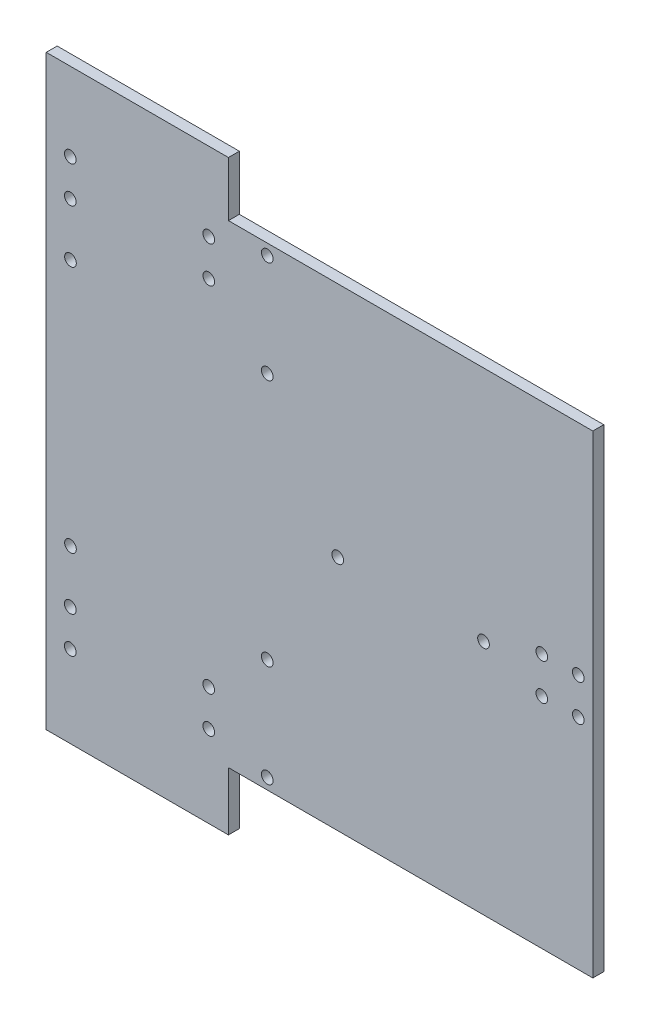
ISO-10303-21;
HEADER;
FILE_DESCRIPTION(('STEP AP214'),'2;1');
FILE_NAME('part.step','',(''),(''),'','','');
FILE_SCHEMA(('AUTOMOTIVE_DESIGN { 1 0 10303 214 1 1 1 1 }'));
ENDSEC;
DATA;
#1=APPLICATION_CONTEXT('core data for automotive mechanical design processes');
#2=APPLICATION_PROTOCOL_DEFINITION('international standard','automotive_design',2000,#1);
#3=PRODUCT_CONTEXT('',#1,'mechanical');
#4=PRODUCT('Part','Part','',(#3));
#5=PRODUCT_RELATED_PRODUCT_CATEGORY('part','',(#4));
#6=PRODUCT_DEFINITION_FORMATION('','',#4);
#7=PRODUCT_DEFINITION_CONTEXT('part definition',#1,'design');
#8=PRODUCT_DEFINITION('design','',#6,#7);
#9=PRODUCT_DEFINITION_SHAPE('','',#8);
#10=(LENGTH_UNIT() NAMED_UNIT(*) SI_UNIT(.MILLI.,.METRE.));
#11=(NAMED_UNIT(*) PLANE_ANGLE_UNIT() SI_UNIT($,.RADIAN.));
#12=(NAMED_UNIT(*) SI_UNIT($,.STERADIAN.) SOLID_ANGLE_UNIT());
#13=UNCERTAINTY_MEASURE_WITH_UNIT(LENGTH_MEASURE(1.E-05),#10,'distance_accuracy_value','');
#14=(GEOMETRIC_REPRESENTATION_CONTEXT(3) GLOBAL_UNCERTAINTY_ASSIGNED_CONTEXT((#13)) GLOBAL_UNIT_ASSIGNED_CONTEXT((#10,
#11,#12)) REPRESENTATION_CONTEXT('',''));
#15=CARTESIAN_POINT('',(0.,0.,0.));
#16=DIRECTION('',(0.,0.,1.));
#17=DIRECTION('',(1.,0.,0.));
#18=AXIS2_PLACEMENT_3D('',#15,#16,#17);
#19=CARTESIAN_POINT('',(-75.,65.,3.));
#20=DIRECTION('',(0.,-1.,0.));
#21=DIRECTION('',(0.,0.,-1.));
#22=AXIS2_PLACEMENT_3D('',#19,#20,#21);
#23=PLANE('',#22);
#24=DIRECTION('',(0.,0.,-1.));
#25=VECTOR('',#24,1.);
#26=CARTESIAN_POINT('',(-25.,65.,3.));
#27=LINE('',#26,#25);
#28=CARTESIAN_POINT('',(-25.,65.,3.));
#29=VERTEX_POINT('',#28);
#30=CARTESIAN_POINT('',(-25.,65.,0.));
#31=VERTEX_POINT('',#30);
#32=EDGE_CURVE('E60',#29,#31,#27,.T.);
#33=ORIENTED_EDGE('',*,*,#32,.F.);
#34=DIRECTION('',(-1.,0.,0.));
#35=VECTOR('',#34,1.);
#36=CARTESIAN_POINT('',(-75.,65.,3.));
#37=LINE('',#36,#35);
#38=CARTESIAN_POINT('',(75.,65.,3.));
#39=VERTEX_POINT('',#38);
#40=EDGE_CURVE('E125',#39,#29,#37,.T.);
#41=ORIENTED_EDGE('',*,*,#40,.F.);
#42=DIRECTION('',(0.,0.,-1.));
#43=VECTOR('',#42,1.);
#44=CARTESIAN_POINT('',(75.,65.,3.));
#45=LINE('',#44,#43);
#46=CARTESIAN_POINT('',(75.,65.,0.));
#47=VERTEX_POINT('',#46);
#48=EDGE_CURVE('E11',#39,#47,#45,.T.);
#49=ORIENTED_EDGE('',*,*,#48,.T.);
#50=DIRECTION('',(-1.,0.,0.));
#51=VECTOR('',#50,1.);
#52=CARTESIAN_POINT('',(-75.,65.,0.));
#53=LINE('',#52,#51);
#54=EDGE_CURVE('E132',#47,#31,#53,.T.);
#55=ORIENTED_EDGE('',*,*,#54,.T.);
#56=EDGE_LOOP('',(#33,#41,#49,#55));
#57=FACE_BOUND('',#56,.T.);
#58=ADVANCED_FACE('F35',(#57),#23,.F.);
#59=CARTESIAN_POINT('',(75.,-65.,3.));
#60=DIRECTION('',(-1.,0.,0.));
#61=DIRECTION('',(0.,0.,1.));
#62=AXIS2_PLACEMENT_3D('',#59,#60,#61);
#63=PLANE('',#62);
#64=DIRECTION('',(0.,1.,0.));
#65=VECTOR('',#64,1.);
#66=CARTESIAN_POINT('',(75.,-65.,0.));
#67=LINE('',#66,#65);
#68=CARTESIAN_POINT('',(75.,-65.,0.));
#69=VERTEX_POINT('',#68);
#70=EDGE_CURVE('E129',#69,#47,#67,.T.);
#71=ORIENTED_EDGE('',*,*,#70,.T.);
#72=ORIENTED_EDGE('',*,*,#48,.F.);
#73=DIRECTION('',(0.,1.,0.));
#74=VECTOR('',#73,1.);
#75=CARTESIAN_POINT('',(75.,-65.,3.));
#76=LINE('',#75,#74);
#77=CARTESIAN_POINT('',(75.,-65.,3.));
#78=VERTEX_POINT('',#77);
#79=EDGE_CURVE('E137',#78,#39,#76,.T.);
#80=ORIENTED_EDGE('',*,*,#79,.F.);
#81=DIRECTION('',(0.,0.,-1.));
#82=VECTOR('',#81,1.);
#83=CARTESIAN_POINT('',(75.,-65.,3.));
#84=LINE('',#83,#82);
#85=EDGE_CURVE('E44',#78,#69,#84,.T.);
#86=ORIENTED_EDGE('',*,*,#85,.T.);
#87=EDGE_LOOP('',(#71,#72,#80,#86));
#88=FACE_BOUND('',#87,.T.);
#89=ADVANCED_FACE('F37',(#88),#63,.F.);
#90=CARTESIAN_POINT('',(-75.,-65.,3.));
#91=DIRECTION('',(1.,0.,0.));
#92=DIRECTION('',(0.,0.,-1.));
#93=AXIS2_PLACEMENT_3D('',#90,#91,#92);
#94=PLANE('',#93);
#95=DIRECTION('',(0.,-1.,0.));
#96=VECTOR('',#95,1.);
#97=CARTESIAN_POINT('',(-75.,-65.,0.));
#98=LINE('',#97,#96);
#99=CARTESIAN_POINT('',(-75.,80.,0.));
#100=VERTEX_POINT('',#99);
#101=CARTESIAN_POINT('',(-75.,-81.,0.));
#102=VERTEX_POINT('',#101);
#103=EDGE_CURVE('E134',#100,#102,#98,.T.);
#104=ORIENTED_EDGE('',*,*,#103,.T.);
#105=DIRECTION('',(0.,0.,-1.));
#106=VECTOR('',#105,1.);
#107=CARTESIAN_POINT('',(-75.,-81.,3.));
#108=LINE('',#107,#106);
#109=CARTESIAN_POINT('',(-75.,-81.,3.));
#110=VERTEX_POINT('',#109);
#111=EDGE_CURVE('E206',#110,#102,#108,.T.);
#112=ORIENTED_EDGE('',*,*,#111,.F.);
#113=DIRECTION('',(0.,-1.,0.));
#114=VECTOR('',#113,1.);
#115=CARTESIAN_POINT('',(-75.,-65.,3.));
#116=LINE('',#115,#114);
#117=CARTESIAN_POINT('',(-75.,80.,3.));
#118=VERTEX_POINT('',#117);
#119=EDGE_CURVE('E122',#118,#110,#116,.T.);
#120=ORIENTED_EDGE('',*,*,#119,.F.);
#121=DIRECTION('',(0.,0.,-1.));
#122=VECTOR('',#121,1.);
#123=CARTESIAN_POINT('',(-75.,80.,3.));
#124=LINE('',#123,#122);
#125=EDGE_CURVE('E218',#118,#100,#124,.T.);
#126=ORIENTED_EDGE('',*,*,#125,.T.);
#127=EDGE_LOOP('',(#104,#112,#120,#126));
#128=FACE_BOUND('',#127,.T.);
#129=ADVANCED_FACE('F240',(#128),#94,.F.);
#130=CARTESIAN_POINT('',(-75.,-65.,3.));
#131=DIRECTION('',(0.,1.,0.));
#132=DIRECTION('',(0.,0.,1.));
#133=AXIS2_PLACEMENT_3D('',#130,#131,#132);
#134=PLANE('',#133);
#135=DIRECTION('',(1.,0.,0.));
#136=VECTOR('',#135,1.);
#137=CARTESIAN_POINT('',(-75.,-65.,3.));
#138=LINE('',#137,#136);
#139=CARTESIAN_POINT('',(-25.,-65.,3.));
#140=VERTEX_POINT('',#139);
#141=EDGE_CURVE('E114',#140,#78,#138,.T.);
#142=ORIENTED_EDGE('',*,*,#141,.F.);
#143=DIRECTION('',(0.,0.,-1.));
#144=VECTOR('',#143,1.);
#145=CARTESIAN_POINT('',(-25.,-65.,3.));
#146=LINE('',#145,#144);
#147=CARTESIAN_POINT('',(-25.,-65.,0.));
#148=VERTEX_POINT('',#147);
#149=EDGE_CURVE('E100',#140,#148,#146,.T.);
#150=ORIENTED_EDGE('',*,*,#149,.T.);
#151=DIRECTION('',(1.,0.,0.));
#152=VECTOR('',#151,1.);
#153=CARTESIAN_POINT('',(-75.,-65.,0.));
#154=LINE('',#153,#152);
#155=EDGE_CURVE('E136',#148,#69,#154,.T.);
#156=ORIENTED_EDGE('',*,*,#155,.T.);
#157=ORIENTED_EDGE('',*,*,#85,.F.);
#158=EDGE_LOOP('',(#142,#150,#156,#157));
#159=FACE_BOUND('',#158,.T.);
#160=ADVANCED_FACE('F119',(#159),#134,.F.);
#161=CARTESIAN_POINT('',(0.,0.,3.));
#162=DIRECTION('',(0.,0.,-1.));
#163=DIRECTION('',(-1.,0.,0.));
#164=AXIS2_PLACEMENT_3D('',#161,#162,#163);
#165=PLANE('',#164);
#166=CARTESIAN_POINT('',(-14.35,34.,3.));
#167=DIRECTION('',(0.,0.,1.));
#168=DIRECTION('',(-1.,0.,0.));
#169=AXIS2_PLACEMENT_3D('',#166,#167,#168);
#170=CIRCLE('',#169,1.6);
#171=CARTESIAN_POINT('',(-15.95,34.,3.));
#172=VERTEX_POINT('',#171);
#173=EDGE_CURVE('E378',#172,#172,#170,.T.);
#174=ORIENTED_EDGE('',*,*,#173,.F.);
#175=EDGE_LOOP('',(#174));
#176=FACE_BOUND('',#175,.T.);
#177=CARTESIAN_POINT('',(-68.3499999999999,34.,3.));
#178=DIRECTION('',(0.,0.,1.));
#179=DIRECTION('',(-1.,0.,0.));
#180=AXIS2_PLACEMENT_3D('',#177,#178,#179);
#181=CIRCLE('',#180,1.60000000000001);
#182=CARTESIAN_POINT('',(-69.9499999999999,34.,3.));
#183=VERTEX_POINT('',#182);
#184=EDGE_CURVE('E382',#183,#183,#181,.T.);
#185=ORIENTED_EDGE('',*,*,#184,.F.);
#186=EDGE_LOOP('',(#185));
#187=FACE_BOUND('',#186,.T.);
#188=CARTESIAN_POINT('',(-30.4,58.5,3.));
#189=DIRECTION('',(0.,0.,1.));
#190=DIRECTION('',(1.,0.,0.));
#191=AXIS2_PLACEMENT_3D('',#188,#189,#190);
#192=CIRCLE('',#191,1.59999999999999);
#193=CARTESIAN_POINT('',(-28.8,58.5,3.));
#194=VERTEX_POINT('',#193);
#195=EDGE_CURVE('E385',#194,#194,#192,.T.);
#196=ORIENTED_EDGE('',*,*,#195,.F.);
#197=EDGE_LOOP('',(#196));
#198=FACE_BOUND('',#197,.T.);
#199=CARTESIAN_POINT('',(-68.4,58.5,3.));
#200=DIRECTION('',(0.,0.,1.));
#201=DIRECTION('',(1.,0.,0.));
#202=AXIS2_PLACEMENT_3D('',#199,#200,#201);
#203=CIRCLE('',#202,1.60000000000001);
#204=CARTESIAN_POINT('',(-66.8,58.5,3.));
#205=VERTEX_POINT('',#204);
#206=EDGE_CURVE('E372',#205,#205,#203,.T.);
#207=ORIENTED_EDGE('',*,*,#206,.F.);
#208=EDGE_LOOP('',(#207));
#209=FACE_BOUND('',#208,.T.);
#210=CARTESIAN_POINT('',(-68.4,48.5,3.));
#211=DIRECTION('',(0.,0.,1.));
#212=DIRECTION('',(-1.,0.,0.));
#213=AXIS2_PLACEMENT_3D('',#210,#211,#212);
#214=CIRCLE('',#213,1.60000000000001);
#215=CARTESIAN_POINT('',(-70.,48.5,3.));
#216=VERTEX_POINT('',#215);
#217=EDGE_CURVE('E369',#216,#216,#214,.T.);
#218=ORIENTED_EDGE('',*,*,#217,.F.);
#219=EDGE_LOOP('',(#218));
#220=FACE_BOUND('',#219,.T.);
#221=CARTESIAN_POINT('',(-30.4,48.5,3.));
#222=DIRECTION('',(0.,0.,1.));
#223=DIRECTION('',(-1.,0.,0.));
#224=AXIS2_PLACEMENT_3D('',#221,#222,#223);
#225=CIRCLE('',#224,1.60000000000001);
#226=CARTESIAN_POINT('',(-32.,48.5,3.));
#227=VERTEX_POINT('',#226);
#228=EDGE_CURVE('E373',#227,#227,#225,.T.);
#229=ORIENTED_EDGE('',*,*,#228,.F.);
#230=EDGE_LOOP('',(#229));
#231=FACE_BOUND('',#230,.T.);
#232=CARTESIAN_POINT('',(-68.4,-48.5,3.));
#233=DIRECTION('',(0.,0.,1.));
#234=DIRECTION('',(1.,0.,0.));
#235=AXIS2_PLACEMENT_3D('',#232,#233,#234);
#236=CIRCLE('',#235,1.60000000000001);
#237=CARTESIAN_POINT('',(-66.8,-48.5,3.));
#238=VERTEX_POINT('',#237);
#239=EDGE_CURVE('E361',#238,#238,#236,.T.);
#240=ORIENTED_EDGE('',*,*,#239,.F.);
#241=EDGE_LOOP('',(#240));
#242=FACE_BOUND('',#241,.T.);
#243=CARTESIAN_POINT('',(-68.4,-58.5,3.));
#244=DIRECTION('',(0.,0.,1.));
#245=DIRECTION('',(-1.,0.,0.));
#246=AXIS2_PLACEMENT_3D('',#243,#244,#245);
#247=CIRCLE('',#246,1.60000000000001);
#248=CARTESIAN_POINT('',(-70.,-58.5,3.));
#249=VERTEX_POINT('',#248);
#250=EDGE_CURVE('E357',#249,#249,#247,.T.);
#251=ORIENTED_EDGE('',*,*,#250,.F.);
#252=EDGE_LOOP('',(#251));
#253=FACE_BOUND('',#252,.T.);
#254=CARTESIAN_POINT('',(-68.35,-34.,3.));
#255=DIRECTION('',(0.,0.,1.));
#256=DIRECTION('',(1.,0.,0.));
#257=AXIS2_PLACEMENT_3D('',#254,#255,#256);
#258=CIRCLE('',#257,1.60000000000001);
#259=CARTESIAN_POINT('',(-66.75,-34.,3.));
#260=VERTEX_POINT('',#259);
#261=EDGE_CURVE('E399',#260,#260,#258,.T.);
#262=ORIENTED_EDGE('',*,*,#261,.F.);
#263=EDGE_LOOP('',(#262));
#264=FACE_BOUND('',#263,.T.);
#265=CARTESIAN_POINT('',(61.,5.,3.));
#266=DIRECTION('',(0.,0.,1.));
#267=DIRECTION('',(1.,0.,0.));
#268=AXIS2_PLACEMENT_3D('',#265,#266,#267);
#269=CIRCLE('',#268,1.6);
#270=CARTESIAN_POINT('',(62.6,5.,3.));
#271=VERTEX_POINT('',#270);
#272=EDGE_CURVE('E402',#271,#271,#269,.T.);
#273=ORIENTED_EDGE('',*,*,#272,.F.);
#274=EDGE_LOOP('',(#273));
#275=FACE_BOUND('',#274,.T.);
#276=CARTESIAN_POINT('',(61.,-5.,3.));
#277=DIRECTION('',(0.,0.,1.));
#278=DIRECTION('',(1.,0.,0.));
#279=AXIS2_PLACEMENT_3D('',#276,#277,#278);
#280=CIRCLE('',#279,1.60000000000001);
#281=CARTESIAN_POINT('',(62.6,-5.,3.));
#282=VERTEX_POINT('',#281);
#283=EDGE_CURVE('E405',#282,#282,#280,.T.);
#284=ORIENTED_EDGE('',*,*,#283,.F.);
#285=EDGE_LOOP('',(#284));
#286=FACE_BOUND('',#285,.T.);
#287=CARTESIAN_POINT('',(71.,5.,3.));
#288=DIRECTION('',(0.,0.,1.));
#289=DIRECTION('',(1.,0.,0.));
#290=AXIS2_PLACEMENT_3D('',#287,#288,#289);
#291=CIRCLE('',#290,1.60000000000001);
#292=CARTESIAN_POINT('',(72.6,5.,3.));
#293=VERTEX_POINT('',#292);
#294=EDGE_CURVE('E408',#293,#293,#291,.T.);
#295=ORIENTED_EDGE('',*,*,#294,.F.);
#296=EDGE_LOOP('',(#295));
#297=FACE_BOUND('',#296,.T.);
#298=CARTESIAN_POINT('',(-14.35,62.,3.));
#299=DIRECTION('',(0.,0.,1.));
#300=DIRECTION('',(-1.,0.,0.));
#301=AXIS2_PLACEMENT_3D('',#298,#299,#300);
#302=CIRCLE('',#301,1.6);
#303=CARTESIAN_POINT('',(-15.95,62.,3.));
#304=VERTEX_POINT('',#303);
#305=EDGE_CURVE('E381',#304,#304,#302,.T.);
#306=ORIENTED_EDGE('',*,*,#305,.F.);
#307=EDGE_LOOP('',(#306));
#308=FACE_BOUND('',#307,.T.);
#309=CARTESIAN_POINT('',(-14.35,-62.,3.));
#310=DIRECTION('',(0.,0.,1.));
#311=DIRECTION('',(1.,0.,0.));
#312=AXIS2_PLACEMENT_3D('',#309,#310,#311);
#313=CIRCLE('',#312,1.6);
#314=CARTESIAN_POINT('',(-12.75,-62.,3.));
#315=VERTEX_POINT('',#314);
#316=EDGE_CURVE('E390',#315,#315,#313,.T.);
#317=ORIENTED_EDGE('',*,*,#316,.F.);
#318=EDGE_LOOP('',(#317));
#319=FACE_BOUND('',#318,.T.);
#320=CARTESIAN_POINT('',(-14.35,-34.,3.));
#321=DIRECTION('',(0.,0.,1.));
#322=DIRECTION('',(1.,0.,0.));
#323=AXIS2_PLACEMENT_3D('',#320,#321,#322);
#324=CIRCLE('',#323,1.6);
#325=CARTESIAN_POINT('',(-12.75,-34.,3.));
#326=VERTEX_POINT('',#325);
#327=EDGE_CURVE('E393',#326,#326,#324,.T.);
#328=ORIENTED_EDGE('',*,*,#327,.F.);
#329=EDGE_LOOP('',(#328));
#330=FACE_BOUND('',#329,.T.);
#331=CARTESIAN_POINT('',(45.,0.,3.));
#332=DIRECTION('',(0.,0.,1.));
#333=DIRECTION('',(1.,0.,0.));
#334=AXIS2_PLACEMENT_3D('',#331,#332,#333);
#335=CIRCLE('',#334,1.6);
#336=CARTESIAN_POINT('',(46.6,0.,3.));
#337=VERTEX_POINT('',#336);
#338=EDGE_CURVE('E396',#337,#337,#335,.T.);
#339=ORIENTED_EDGE('',*,*,#338,.F.);
#340=EDGE_LOOP('',(#339));
#341=FACE_BOUND('',#340,.T.);
#342=CARTESIAN_POINT('',(-30.4,-58.5,3.));
#343=DIRECTION('',(0.,0.,1.));
#344=DIRECTION('',(-1.,0.,0.));
#345=AXIS2_PLACEMENT_3D('',#342,#343,#344);
#346=CIRCLE('',#345,1.59999999999999);
#347=CARTESIAN_POINT('',(-32.,-58.5,3.));
#348=VERTEX_POINT('',#347);
#349=EDGE_CURVE('E355',#348,#348,#346,.T.);
#350=ORIENTED_EDGE('',*,*,#349,.F.);
#351=EDGE_LOOP('',(#350));
#352=FACE_BOUND('',#351,.T.);
#353=CARTESIAN_POINT('',(-30.4,-48.5,3.));
#354=DIRECTION('',(0.,0.,1.));
#355=DIRECTION('',(1.,0.,0.));
#356=AXIS2_PLACEMENT_3D('',#353,#354,#355);
#357=CIRCLE('',#356,1.59999999999999);
#358=CARTESIAN_POINT('',(-28.8,-48.5,3.));
#359=VERTEX_POINT('',#358);
#360=EDGE_CURVE('E358',#359,#359,#357,.T.);
#361=ORIENTED_EDGE('',*,*,#360,.F.);
#362=EDGE_LOOP('',(#361));
#363=FACE_BOUND('',#362,.T.);
#364=CARTESIAN_POINT('',(4.99999999999998,0.,3.));
#365=DIRECTION('',(0.,0.,1.));
#366=DIRECTION('',(1.,0.,0.));
#367=AXIS2_PLACEMENT_3D('',#364,#365,#366);
#368=CIRCLE('',#367,1.6);
#369=CARTESIAN_POINT('',(6.59999999999998,0.,3.));
#370=VERTEX_POINT('',#369);
#371=EDGE_CURVE('E364',#370,#370,#368,.T.);
#372=ORIENTED_EDGE('',*,*,#371,.F.);
#373=EDGE_LOOP('',(#372));
#374=FACE_BOUND('',#373,.T.);
#375=CARTESIAN_POINT('',(71.,-5.,3.));
#376=DIRECTION('',(0.,0.,1.));
#377=DIRECTION('',(1.,0.,0.));
#378=AXIS2_PLACEMENT_3D('',#375,#376,#377);
#379=CIRCLE('',#378,1.60000000000001);
#380=CARTESIAN_POINT('',(72.6,-5.,3.));
#381=VERTEX_POINT('',#380);
#382=EDGE_CURVE('E143',#381,#381,#379,.T.);
#383=ORIENTED_EDGE('',*,*,#382,.F.);
#384=EDGE_LOOP('',(#383));
#385=FACE_BOUND('',#384,.T.);
#386=ORIENTED_EDGE('',*,*,#79,.T.);
#387=ORIENTED_EDGE('',*,*,#40,.T.);
#388=DIRECTION('',(0.,-1.,0.));
#389=VECTOR('',#388,1.);
#390=CARTESIAN_POINT('',(-25.,80.,3.));
#391=LINE('',#390,#389);
#392=CARTESIAN_POINT('',(-25.,80.,3.));
#393=VERTEX_POINT('',#392);
#394=EDGE_CURVE('E214',#393,#29,#391,.T.);
#395=ORIENTED_EDGE('',*,*,#394,.F.);
#396=DIRECTION('',(1.,0.,0.));
#397=VECTOR('',#396,1.);
#398=CARTESIAN_POINT('',(-75.,80.,3.));
#399=LINE('',#398,#397);
#400=EDGE_CURVE('E211',#118,#393,#399,.T.);
#401=ORIENTED_EDGE('',*,*,#400,.F.);
#402=ORIENTED_EDGE('',*,*,#119,.T.);
#403=DIRECTION('',(-1.,0.,0.));
#404=VECTOR('',#403,1.);
#405=CARTESIAN_POINT('',(-75.,-81.,3.));
#406=LINE('',#405,#404);
#407=CARTESIAN_POINT('',(-25.,-81.,3.));
#408=VERTEX_POINT('',#407);
#409=EDGE_CURVE('E108',#408,#110,#406,.T.);
#410=ORIENTED_EDGE('',*,*,#409,.F.);
#411=DIRECTION('',(0.,-1.,0.));
#412=VECTOR('',#411,1.);
#413=CARTESIAN_POINT('',(-25.,-81.,3.));
#414=LINE('',#413,#412);
#415=EDGE_CURVE('E103',#140,#408,#414,.T.);
#416=ORIENTED_EDGE('',*,*,#415,.F.);
#417=ORIENTED_EDGE('',*,*,#141,.T.);
#418=EDGE_LOOP('',(#386,#387,#395,#401,#402,#410,#416,#417));
#419=FACE_BOUND('',#418,.T.);
#420=ADVANCED_FACE('F113',(#176,#187,#198,#209,#220,#231,#242,#253,#264,#275,#286,#297,#308,
#319,#330,#341,#352,#363,#374,#385,#419),#165,.F.);
#421=CARTESIAN_POINT('',(0.,0.,0.));
#422=DIRECTION('',(0.,0.,-1.));
#423=DIRECTION('',(-1.,0.,0.));
#424=AXIS2_PLACEMENT_3D('',#421,#422,#423);
#425=PLANE('',#424);
#426=CARTESIAN_POINT('',(-14.35,34.,0.));
#427=DIRECTION('',(0.,0.,-1.));
#428=DIRECTION('',(-1.,0.,0.));
#429=AXIS2_PLACEMENT_3D('',#426,#427,#428);
#430=CIRCLE('',#429,1.6);
#431=CARTESIAN_POINT('',(-15.95,34.,0.));
#432=VERTEX_POINT('',#431);
#433=EDGE_CURVE('E39',#432,#432,#430,.T.);
#434=ORIENTED_EDGE('',*,*,#433,.F.);
#435=EDGE_LOOP('',(#434));
#436=FACE_BOUND('',#435,.T.);
#437=CARTESIAN_POINT('',(-68.3499999999999,34.,0.));
#438=DIRECTION('',(0.,0.,-1.));
#439=DIRECTION('',(-1.,0.,0.));
#440=AXIS2_PLACEMENT_3D('',#437,#438,#439);
#441=CIRCLE('',#440,1.60000000000001);
#442=CARTESIAN_POINT('',(-69.9499999999999,34.,0.));
#443=VERTEX_POINT('',#442);
#444=EDGE_CURVE('E193',#443,#443,#441,.T.);
#445=ORIENTED_EDGE('',*,*,#444,.F.);
#446=EDGE_LOOP('',(#445));
#447=FACE_BOUND('',#446,.T.);
#448=CARTESIAN_POINT('',(-30.4,58.5,0.));
#449=DIRECTION('',(0.,0.,-1.));
#450=DIRECTION('',(-1.,0.,0.));
#451=AXIS2_PLACEMENT_3D('',#448,#449,#450);
#452=CIRCLE('',#451,1.59999999999999);
#453=CARTESIAN_POINT('',(-32.,58.5,0.));
#454=VERTEX_POINT('',#453);
#455=EDGE_CURVE('E191',#454,#454,#452,.T.);
#456=ORIENTED_EDGE('',*,*,#455,.F.);
#457=EDGE_LOOP('',(#456));
#458=FACE_BOUND('',#457,.T.);
#459=CARTESIAN_POINT('',(-68.4,58.5,0.));
#460=DIRECTION('',(0.,0.,-1.));
#461=DIRECTION('',(-1.,0.,0.));
#462=AXIS2_PLACEMENT_3D('',#459,#460,#461);
#463=CIRCLE('',#462,1.60000000000001);
#464=CARTESIAN_POINT('',(-70.,58.5,0.));
#465=VERTEX_POINT('',#464);
#466=EDGE_CURVE('E188',#465,#465,#463,.T.);
#467=ORIENTED_EDGE('',*,*,#466,.F.);
#468=EDGE_LOOP('',(#467));
#469=FACE_BOUND('',#468,.T.);
#470=CARTESIAN_POINT('',(-68.4,48.5,0.));
#471=DIRECTION('',(0.,0.,-1.));
#472=DIRECTION('',(-1.,0.,0.));
#473=AXIS2_PLACEMENT_3D('',#470,#471,#472);
#474=CIRCLE('',#473,1.60000000000001);
#475=CARTESIAN_POINT('',(-70.,48.5,0.));
#476=VERTEX_POINT('',#475);
#477=EDGE_CURVE('E185',#476,#476,#474,.T.);
#478=ORIENTED_EDGE('',*,*,#477,.F.);
#479=EDGE_LOOP('',(#478));
#480=FACE_BOUND('',#479,.T.);
#481=CARTESIAN_POINT('',(-30.4,48.5,0.));
#482=DIRECTION('',(0.,0.,-1.));
#483=DIRECTION('',(-1.,0.,0.));
#484=AXIS2_PLACEMENT_3D('',#481,#482,#483);
#485=CIRCLE('',#484,1.60000000000001);
#486=CARTESIAN_POINT('',(-32.,48.5,0.));
#487=VERTEX_POINT('',#486);
#488=EDGE_CURVE('E182',#487,#487,#485,.T.);
#489=ORIENTED_EDGE('',*,*,#488,.F.);
#490=EDGE_LOOP('',(#489));
#491=FACE_BOUND('',#490,.T.);
#492=CARTESIAN_POINT('',(-68.4,-48.5,0.));
#493=DIRECTION('',(0.,0.,-1.));
#494=DIRECTION('',(-1.,0.,0.));
#495=AXIS2_PLACEMENT_3D('',#492,#493,#494);
#496=CIRCLE('',#495,1.60000000000001);
#497=CARTESIAN_POINT('',(-70.,-48.5,0.));
#498=VERTEX_POINT('',#497);
#499=EDGE_CURVE('E179',#498,#498,#496,.T.);
#500=ORIENTED_EDGE('',*,*,#499,.F.);
#501=EDGE_LOOP('',(#500));
#502=FACE_BOUND('',#501,.T.);
#503=CARTESIAN_POINT('',(-68.4,-58.5,0.));
#504=DIRECTION('',(0.,0.,-1.));
#505=DIRECTION('',(-1.,0.,0.));
#506=AXIS2_PLACEMENT_3D('',#503,#504,#505);
#507=CIRCLE('',#506,1.60000000000001);
#508=CARTESIAN_POINT('',(-70.,-58.5,0.));
#509=VERTEX_POINT('',#508);
#510=EDGE_CURVE('E176',#509,#509,#507,.T.);
#511=ORIENTED_EDGE('',*,*,#510,.F.);
#512=EDGE_LOOP('',(#511));
#513=FACE_BOUND('',#512,.T.);
#514=CARTESIAN_POINT('',(-68.35,-34.,0.));
#515=DIRECTION('',(0.,0.,-1.));
#516=DIRECTION('',(-1.,0.,0.));
#517=AXIS2_PLACEMENT_3D('',#514,#515,#516);
#518=CIRCLE('',#517,1.60000000000001);
#519=CARTESIAN_POINT('',(-69.95,-34.,0.));
#520=VERTEX_POINT('',#519);
#521=EDGE_CURVE('E173',#520,#520,#518,.T.);
#522=ORIENTED_EDGE('',*,*,#521,.F.);
#523=EDGE_LOOP('',(#522));
#524=FACE_BOUND('',#523,.T.);
#525=CARTESIAN_POINT('',(61.,5.,0.));
#526=DIRECTION('',(0.,0.,-1.));
#527=DIRECTION('',(-1.,0.,0.));
#528=AXIS2_PLACEMENT_3D('',#525,#526,#527);
#529=CIRCLE('',#528,1.6);
#530=CARTESIAN_POINT('',(59.4,5.,0.));
#531=VERTEX_POINT('',#530);
#532=EDGE_CURVE('E170',#531,#531,#529,.T.);
#533=ORIENTED_EDGE('',*,*,#532,.F.);
#534=EDGE_LOOP('',(#533));
#535=FACE_BOUND('',#534,.T.);
#536=CARTESIAN_POINT('',(61.,-5.,0.));
#537=DIRECTION('',(0.,0.,-1.));
#538=DIRECTION('',(-1.,0.,0.));
#539=AXIS2_PLACEMENT_3D('',#536,#537,#538);
#540=CIRCLE('',#539,1.60000000000001);
#541=CARTESIAN_POINT('',(59.4,-5.,0.));
#542=VERTEX_POINT('',#541);
#543=EDGE_CURVE('E167',#542,#542,#540,.T.);
#544=ORIENTED_EDGE('',*,*,#543,.F.);
#545=EDGE_LOOP('',(#544));
#546=FACE_BOUND('',#545,.T.);
#547=CARTESIAN_POINT('',(71.,5.,0.));
#548=DIRECTION('',(0.,0.,-1.));
#549=DIRECTION('',(-1.,0.,0.));
#550=AXIS2_PLACEMENT_3D('',#547,#548,#549);
#551=CIRCLE('',#550,1.60000000000001);
#552=CARTESIAN_POINT('',(69.4,5.,0.));
#553=VERTEX_POINT('',#552);
#554=EDGE_CURVE('E164',#553,#553,#551,.T.);
#555=ORIENTED_EDGE('',*,*,#554,.F.);
#556=EDGE_LOOP('',(#555));
#557=FACE_BOUND('',#556,.T.);
#558=CARTESIAN_POINT('',(-14.35,62.,0.));
#559=DIRECTION('',(0.,0.,-1.));
#560=DIRECTION('',(-1.,0.,0.));
#561=AXIS2_PLACEMENT_3D('',#558,#559,#560);
#562=CIRCLE('',#561,1.6);
#563=CARTESIAN_POINT('',(-15.95,62.,0.));
#564=VERTEX_POINT('',#563);
#565=EDGE_CURVE('E161',#564,#564,#562,.T.);
#566=ORIENTED_EDGE('',*,*,#565,.F.);
#567=EDGE_LOOP('',(#566));
#568=FACE_BOUND('',#567,.T.);
#569=CARTESIAN_POINT('',(-14.35,-62.,0.));
#570=DIRECTION('',(0.,0.,-1.));
#571=DIRECTION('',(-1.,0.,0.));
#572=AXIS2_PLACEMENT_3D('',#569,#570,#571);
#573=CIRCLE('',#572,1.6);
#574=CARTESIAN_POINT('',(-15.95,-62.,0.));
#575=VERTEX_POINT('',#574);
#576=EDGE_CURVE('E158',#575,#575,#573,.T.);
#577=ORIENTED_EDGE('',*,*,#576,.F.);
#578=EDGE_LOOP('',(#577));
#579=FACE_BOUND('',#578,.T.);
#580=CARTESIAN_POINT('',(-14.35,-34.,0.));
#581=DIRECTION('',(0.,0.,-1.));
#582=DIRECTION('',(-1.,0.,0.));
#583=AXIS2_PLACEMENT_3D('',#580,#581,#582);
#584=CIRCLE('',#583,1.6);
#585=CARTESIAN_POINT('',(-15.95,-34.,0.));
#586=VERTEX_POINT('',#585);
#587=EDGE_CURVE('E155',#586,#586,#584,.T.);
#588=ORIENTED_EDGE('',*,*,#587,.F.);
#589=EDGE_LOOP('',(#588));
#590=FACE_BOUND('',#589,.T.);
#591=CARTESIAN_POINT('',(45.,0.,0.));
#592=DIRECTION('',(0.,0.,-1.));
#593=DIRECTION('',(-1.,0.,0.));
#594=AXIS2_PLACEMENT_3D('',#591,#592,#593);
#595=CIRCLE('',#594,1.6);
#596=CARTESIAN_POINT('',(43.4,0.,0.));
#597=VERTEX_POINT('',#596);
#598=EDGE_CURVE('E152',#597,#597,#595,.T.);
#599=ORIENTED_EDGE('',*,*,#598,.F.);
#600=EDGE_LOOP('',(#599));
#601=FACE_BOUND('',#600,.T.);
#602=CARTESIAN_POINT('',(-30.4,-58.5,0.));
#603=DIRECTION('',(0.,0.,-1.));
#604=DIRECTION('',(-1.,0.,0.));
#605=AXIS2_PLACEMENT_3D('',#602,#603,#604);
#606=CIRCLE('',#605,1.59999999999999);
#607=CARTESIAN_POINT('',(-32.,-58.5,0.));
#608=VERTEX_POINT('',#607);
#609=EDGE_CURVE('E149',#608,#608,#606,.T.);
#610=ORIENTED_EDGE('',*,*,#609,.F.);
#611=EDGE_LOOP('',(#610));
#612=FACE_BOUND('',#611,.T.);
#613=CARTESIAN_POINT('',(-30.4,-48.5,0.));
#614=DIRECTION('',(0.,0.,-1.));
#615=DIRECTION('',(-1.,0.,0.));
#616=AXIS2_PLACEMENT_3D('',#613,#614,#615);
#617=CIRCLE('',#616,1.59999999999999);
#618=CARTESIAN_POINT('',(-32.,-48.5,0.));
#619=VERTEX_POINT('',#618);
#620=EDGE_CURVE('E146',#619,#619,#617,.T.);
#621=ORIENTED_EDGE('',*,*,#620,.F.);
#622=EDGE_LOOP('',(#621));
#623=FACE_BOUND('',#622,.T.);
#624=CARTESIAN_POINT('',(4.99999999999998,0.,0.));
#625=DIRECTION('',(0.,0.,-1.));
#626=DIRECTION('',(-1.,0.,0.));
#627=AXIS2_PLACEMENT_3D('',#624,#625,#626);
#628=CIRCLE('',#627,1.6);
#629=CARTESIAN_POINT('',(3.39999999999998,0.,0.));
#630=VERTEX_POINT('',#629);
#631=EDGE_CURVE('E142',#630,#630,#628,.T.);
#632=ORIENTED_EDGE('',*,*,#631,.F.);
#633=EDGE_LOOP('',(#632));
#634=FACE_BOUND('',#633,.T.);
#635=CARTESIAN_POINT('',(71.,-5.,0.));
#636=DIRECTION('',(0.,0.,-1.));
#637=DIRECTION('',(-1.,0.,0.));
#638=AXIS2_PLACEMENT_3D('',#635,#636,#637);
#639=CIRCLE('',#638,1.60000000000001);
#640=CARTESIAN_POINT('',(69.4,-5.,0.));
#641=VERTEX_POINT('',#640);
#642=EDGE_CURVE('E139',#641,#641,#639,.T.);
#643=ORIENTED_EDGE('',*,*,#642,.F.);
#644=EDGE_LOOP('',(#643));
#645=FACE_BOUND('',#644,.T.);
#646=ORIENTED_EDGE('',*,*,#70,.F.);
#647=ORIENTED_EDGE('',*,*,#155,.F.);
#648=DIRECTION('',(0.,-1.,0.));
#649=VECTOR('',#648,1.);
#650=CARTESIAN_POINT('',(-25.,-81.,0.));
#651=LINE('',#650,#649);
#652=CARTESIAN_POINT('',(-25.,-81.,0.));
#653=VERTEX_POINT('',#652);
#654=EDGE_CURVE('E52',#148,#653,#651,.T.);
#655=ORIENTED_EDGE('',*,*,#654,.T.);
#656=DIRECTION('',(-1.,0.,0.));
#657=VECTOR('',#656,1.);
#658=CARTESIAN_POINT('',(-75.,-81.,0.));
#659=LINE('',#658,#657);
#660=EDGE_CURVE('E117',#653,#102,#659,.T.);
#661=ORIENTED_EDGE('',*,*,#660,.T.);
#662=ORIENTED_EDGE('',*,*,#103,.F.);
#663=DIRECTION('',(1.,0.,0.));
#664=VECTOR('',#663,1.);
#665=CARTESIAN_POINT('',(-75.,80.,0.));
#666=LINE('',#665,#664);
#667=CARTESIAN_POINT('',(-25.,80.,0.));
#668=VERTEX_POINT('',#667);
#669=EDGE_CURVE('E209',#100,#668,#666,.T.);
#670=ORIENTED_EDGE('',*,*,#669,.T.);
#671=DIRECTION('',(0.,-1.,0.));
#672=VECTOR('',#671,1.);
#673=CARTESIAN_POINT('',(-25.,80.,0.));
#674=LINE('',#673,#672);
#675=EDGE_CURVE('E215',#668,#31,#674,.T.);
#676=ORIENTED_EDGE('',*,*,#675,.T.);
#677=ORIENTED_EDGE('',*,*,#54,.F.);
#678=EDGE_LOOP('',(#646,#647,#655,#661,#662,#670,#676,#677));
#679=FACE_BOUND('',#678,.T.);
#680=ADVANCED_FACE('F245',(#436,#447,#458,#469,#480,#491,#502,#513,#524,#535,#546,#557,#568,
#579,#590,#601,#612,#623,#634,#645,#679),#425,.T.);
#681=CARTESIAN_POINT('',(-25.,80.,3.));
#682=DIRECTION('',(1.,0.,0.));
#683=DIRECTION('',(0.,0.,-1.));
#684=AXIS2_PLACEMENT_3D('',#681,#682,#683);
#685=PLANE('',#684);
#686=ORIENTED_EDGE('',*,*,#675,.F.);
#687=DIRECTION('',(0.,0.,-1.));
#688=VECTOR('',#687,1.);
#689=CARTESIAN_POINT('',(-25.,80.,3.));
#690=LINE('',#689,#688);
#691=EDGE_CURVE('E224',#393,#668,#690,.T.);
#692=ORIENTED_EDGE('',*,*,#691,.F.);
#693=ORIENTED_EDGE('',*,*,#394,.T.);
#694=ORIENTED_EDGE('',*,*,#32,.T.);
#695=EDGE_LOOP('',(#686,#692,#693,#694));
#696=FACE_BOUND('',#695,.T.);
#697=ADVANCED_FACE('F233',(#696),#685,.T.);
#698=CARTESIAN_POINT('',(-75.,80.,3.));
#699=DIRECTION('',(0.,1.,0.));
#700=DIRECTION('',(-1.,0.,0.));
#701=AXIS2_PLACEMENT_3D('',#698,#699,#700);
#702=PLANE('',#701);
#703=ORIENTED_EDGE('',*,*,#669,.F.);
#704=ORIENTED_EDGE('',*,*,#125,.F.);
#705=ORIENTED_EDGE('',*,*,#400,.T.);
#706=ORIENTED_EDGE('',*,*,#691,.T.);
#707=EDGE_LOOP('',(#703,#704,#705,#706));
#708=FACE_BOUND('',#707,.T.);
#709=ADVANCED_FACE('F237',(#708),#702,.T.);
#710=CARTESIAN_POINT('',(-75.,-81.,3.));
#711=DIRECTION('',(0.,-1.,0.));
#712=DIRECTION('',(0.,0.,-1.));
#713=AXIS2_PLACEMENT_3D('',#710,#711,#712);
#714=PLANE('',#713);
#715=ORIENTED_EDGE('',*,*,#660,.F.);
#716=DIRECTION('',(0.,0.,-1.));
#717=VECTOR('',#716,1.);
#718=CARTESIAN_POINT('',(-25.,-81.,3.));
#719=LINE('',#718,#717);
#720=EDGE_CURVE('E107',#408,#653,#719,.T.);
#721=ORIENTED_EDGE('',*,*,#720,.F.);
#722=ORIENTED_EDGE('',*,*,#409,.T.);
#723=ORIENTED_EDGE('',*,*,#111,.T.);
#724=EDGE_LOOP('',(#715,#721,#722,#723));
#725=FACE_BOUND('',#724,.T.);
#726=ADVANCED_FACE('F243',(#725),#714,.T.);
#727=CARTESIAN_POINT('',(-25.,-81.,3.));
#728=DIRECTION('',(1.,0.,0.));
#729=DIRECTION('',(0.,0.,-1.));
#730=AXIS2_PLACEMENT_3D('',#727,#728,#729);
#731=PLANE('',#730);
#732=ORIENTED_EDGE('',*,*,#654,.F.);
#733=ORIENTED_EDGE('',*,*,#149,.F.);
#734=ORIENTED_EDGE('',*,*,#415,.T.);
#735=ORIENTED_EDGE('',*,*,#720,.T.);
#736=EDGE_LOOP('',(#732,#733,#734,#735));
#737=FACE_BOUND('',#736,.T.);
#738=ADVANCED_FACE('F102',(#737),#731,.T.);
#739=CARTESIAN_POINT('',(71.,-5.,-7.));
#740=DIRECTION('',(0.,0.,1.));
#741=DIRECTION('',(1.,0.,0.));
#742=AXIS2_PLACEMENT_3D('',#739,#740,#741);
#743=CYLINDRICAL_SURFACE('',#742,1.60000000000001);
#744=ORIENTED_EDGE('',*,*,#642,.T.);
#745=EDGE_LOOP('',(#744));
#746=FACE_BOUND('',#745,.T.);
#747=ORIENTED_EDGE('',*,*,#382,.T.);
#748=EDGE_LOOP('',(#747));
#749=FACE_BOUND('',#748,.T.);
#750=ADVANCED_FACE('F270',(#746,#749),#743,.F.);
#751=CARTESIAN_POINT('',(4.99999999999998,0.,-7.));
#752=DIRECTION('',(0.,0.,1.));
#753=DIRECTION('',(1.,0.,0.));
#754=AXIS2_PLACEMENT_3D('',#751,#752,#753);
#755=CYLINDRICAL_SURFACE('',#754,1.6);
#756=ORIENTED_EDGE('',*,*,#631,.T.);
#757=EDGE_LOOP('',(#756));
#758=FACE_BOUND('',#757,.T.);
#759=ORIENTED_EDGE('',*,*,#371,.T.);
#760=EDGE_LOOP('',(#759));
#761=FACE_BOUND('',#760,.T.);
#762=ADVANCED_FACE('F275',(#758,#761),#755,.F.);
#763=CARTESIAN_POINT('',(-30.4,-48.5,-7.));
#764=DIRECTION('',(0.,0.,1.));
#765=DIRECTION('',(1.,0.,0.));
#766=AXIS2_PLACEMENT_3D('',#763,#764,#765);
#767=CYLINDRICAL_SURFACE('',#766,1.59999999999999);
#768=ORIENTED_EDGE('',*,*,#620,.T.);
#769=EDGE_LOOP('',(#768));
#770=FACE_BOUND('',#769,.T.);
#771=ORIENTED_EDGE('',*,*,#360,.T.);
#772=EDGE_LOOP('',(#771));
#773=FACE_BOUND('',#772,.T.);
#774=ADVANCED_FACE('F342',(#770,#773),#767,.F.);
#775=CARTESIAN_POINT('',(-30.4,-58.5,-7.));
#776=DIRECTION('',(0.,0.,1.));
#777=DIRECTION('',(1.,0.,0.));
#778=AXIS2_PLACEMENT_3D('',#775,#776,#777);
#779=CYLINDRICAL_SURFACE('',#778,1.59999999999999);
#780=ORIENTED_EDGE('',*,*,#609,.T.);
#781=EDGE_LOOP('',(#780));
#782=FACE_BOUND('',#781,.T.);
#783=ORIENTED_EDGE('',*,*,#349,.T.);
#784=EDGE_LOOP('',(#783));
#785=FACE_BOUND('',#784,.T.);
#786=ADVANCED_FACE('F303',(#782,#785),#779,.F.);
#787=CARTESIAN_POINT('',(45.,0.,-7.));
#788=DIRECTION('',(0.,0.,1.));
#789=DIRECTION('',(1.,0.,0.));
#790=AXIS2_PLACEMENT_3D('',#787,#788,#789);
#791=CYLINDRICAL_SURFACE('',#790,1.6);
#792=ORIENTED_EDGE('',*,*,#598,.T.);
#793=EDGE_LOOP('',(#792));
#794=FACE_BOUND('',#793,.T.);
#795=ORIENTED_EDGE('',*,*,#338,.T.);
#796=EDGE_LOOP('',(#795));
#797=FACE_BOUND('',#796,.T.);
#798=ADVANCED_FACE('F299',(#794,#797),#791,.F.);
#799=CARTESIAN_POINT('',(-14.35,-34.,-7.));
#800=DIRECTION('',(0.,0.,1.));
#801=DIRECTION('',(1.,0.,0.));
#802=AXIS2_PLACEMENT_3D('',#799,#800,#801);
#803=CYLINDRICAL_SURFACE('',#802,1.6);
#804=ORIENTED_EDGE('',*,*,#587,.T.);
#805=EDGE_LOOP('',(#804));
#806=FACE_BOUND('',#805,.T.);
#807=ORIENTED_EDGE('',*,*,#327,.T.);
#808=EDGE_LOOP('',(#807));
#809=FACE_BOUND('',#808,.T.);
#810=ADVANCED_FACE('F295',(#806,#809),#803,.F.);
#811=CARTESIAN_POINT('',(-14.35,-62.,-7.));
#812=DIRECTION('',(0.,0.,1.));
#813=DIRECTION('',(1.,0.,0.));
#814=AXIS2_PLACEMENT_3D('',#811,#812,#813);
#815=CYLINDRICAL_SURFACE('',#814,1.6);
#816=ORIENTED_EDGE('',*,*,#576,.T.);
#817=EDGE_LOOP('',(#816));
#818=FACE_BOUND('',#817,.T.);
#819=ORIENTED_EDGE('',*,*,#316,.T.);
#820=EDGE_LOOP('',(#819));
#821=FACE_BOUND('',#820,.T.);
#822=ADVANCED_FACE('F298',(#818,#821),#815,.F.);
#823=CARTESIAN_POINT('',(-14.35,62.,-7.));
#824=DIRECTION('',(0.,0.,1.));
#825=DIRECTION('',(1.,0.,0.));
#826=AXIS2_PLACEMENT_3D('',#823,#824,#825);
#827=CYLINDRICAL_SURFACE('',#826,1.6);
#828=ORIENTED_EDGE('',*,*,#565,.T.);
#829=EDGE_LOOP('',(#828));
#830=FACE_BOUND('',#829,.T.);
#831=ORIENTED_EDGE('',*,*,#305,.T.);
#832=EDGE_LOOP('',(#831));
#833=FACE_BOUND('',#832,.T.);
#834=ADVANCED_FACE('F285',(#830,#833),#827,.F.);
#835=CARTESIAN_POINT('',(71.,5.,-7.));
#836=DIRECTION('',(0.,0.,1.));
#837=DIRECTION('',(1.,0.,0.));
#838=AXIS2_PLACEMENT_3D('',#835,#836,#837);
#839=CYLINDRICAL_SURFACE('',#838,1.60000000000001);
#840=ORIENTED_EDGE('',*,*,#554,.T.);
#841=EDGE_LOOP('',(#840));
#842=FACE_BOUND('',#841,.T.);
#843=ORIENTED_EDGE('',*,*,#294,.T.);
#844=EDGE_LOOP('',(#843));
#845=FACE_BOUND('',#844,.T.);
#846=ADVANCED_FACE('F281',(#842,#845),#839,.F.);
#847=CARTESIAN_POINT('',(61.,-5.,-7.));
#848=DIRECTION('',(0.,0.,1.));
#849=DIRECTION('',(1.,0.,0.));
#850=AXIS2_PLACEMENT_3D('',#847,#848,#849);
#851=CYLINDRICAL_SURFACE('',#850,1.60000000000001);
#852=ORIENTED_EDGE('',*,*,#543,.T.);
#853=EDGE_LOOP('',(#852));
#854=FACE_BOUND('',#853,.T.);
#855=ORIENTED_EDGE('',*,*,#283,.T.);
#856=EDGE_LOOP('',(#855));
#857=FACE_BOUND('',#856,.T.);
#858=ADVANCED_FACE('F277',(#854,#857),#851,.F.);
#859=CARTESIAN_POINT('',(61.,5.,-7.));
#860=DIRECTION('',(0.,0.,1.));
#861=DIRECTION('',(1.,0.,0.));
#862=AXIS2_PLACEMENT_3D('',#859,#860,#861);
#863=CYLINDRICAL_SURFACE('',#862,1.6);
#864=ORIENTED_EDGE('',*,*,#532,.T.);
#865=EDGE_LOOP('',(#864));
#866=FACE_BOUND('',#865,.T.);
#867=ORIENTED_EDGE('',*,*,#272,.T.);
#868=EDGE_LOOP('',(#867));
#869=FACE_BOUND('',#868,.T.);
#870=ADVANCED_FACE('F280',(#866,#869),#863,.F.);
#871=CARTESIAN_POINT('',(-68.35,-34.,-7.));
#872=DIRECTION('',(0.,0.,1.));
#873=DIRECTION('',(1.,0.,0.));
#874=AXIS2_PLACEMENT_3D('',#871,#872,#873);
#875=CYLINDRICAL_SURFACE('',#874,1.60000000000001);
#876=ORIENTED_EDGE('',*,*,#521,.T.);
#877=EDGE_LOOP('',(#876));
#878=FACE_BOUND('',#877,.T.);
#879=ORIENTED_EDGE('',*,*,#261,.T.);
#880=EDGE_LOOP('',(#879));
#881=FACE_BOUND('',#880,.T.);
#882=ADVANCED_FACE('F287',(#878,#881),#875,.F.);
#883=CARTESIAN_POINT('',(-68.4,-58.5,-7.));
#884=DIRECTION('',(0.,0.,1.));
#885=DIRECTION('',(1.,0.,0.));
#886=AXIS2_PLACEMENT_3D('',#883,#884,#885);
#887=CYLINDRICAL_SURFACE('',#886,1.60000000000001);
#888=ORIENTED_EDGE('',*,*,#510,.T.);
#889=EDGE_LOOP('',(#888));
#890=FACE_BOUND('',#889,.T.);
#891=ORIENTED_EDGE('',*,*,#250,.T.);
#892=EDGE_LOOP('',(#891));
#893=FACE_BOUND('',#892,.T.);
#894=ADVANCED_FACE('F290',(#890,#893),#887,.F.);
#895=CARTESIAN_POINT('',(-68.4,-48.5,-7.));
#896=DIRECTION('',(0.,0.,1.));
#897=DIRECTION('',(1.,0.,0.));
#898=AXIS2_PLACEMENT_3D('',#895,#896,#897);
#899=CYLINDRICAL_SURFACE('',#898,1.60000000000001);
#900=ORIENTED_EDGE('',*,*,#499,.T.);
#901=EDGE_LOOP('',(#900));
#902=FACE_BOUND('',#901,.T.);
#903=ORIENTED_EDGE('',*,*,#239,.T.);
#904=EDGE_LOOP('',(#903));
#905=FACE_BOUND('',#904,.T.);
#906=ADVANCED_FACE('F328',(#902,#905),#899,.F.);
#907=CARTESIAN_POINT('',(-30.4,48.5,-7.));
#908=DIRECTION('',(0.,0.,1.));
#909=DIRECTION('',(1.,0.,0.));
#910=AXIS2_PLACEMENT_3D('',#907,#908,#909);
#911=CYLINDRICAL_SURFACE('',#910,1.60000000000001);
#912=ORIENTED_EDGE('',*,*,#488,.T.);
#913=EDGE_LOOP('',(#912));
#914=FACE_BOUND('',#913,.T.);
#915=ORIENTED_EDGE('',*,*,#228,.T.);
#916=EDGE_LOOP('',(#915));
#917=FACE_BOUND('',#916,.T.);
#918=ADVANCED_FACE('F332',(#914,#917),#911,.F.);
#919=CARTESIAN_POINT('',(-68.4,48.5,-7.));
#920=DIRECTION('',(0.,0.,1.));
#921=DIRECTION('',(1.,0.,0.));
#922=AXIS2_PLACEMENT_3D('',#919,#920,#921);
#923=CYLINDRICAL_SURFACE('',#922,1.60000000000001);
#924=ORIENTED_EDGE('',*,*,#477,.T.);
#925=EDGE_LOOP('',(#924));
#926=FACE_BOUND('',#925,.T.);
#927=ORIENTED_EDGE('',*,*,#217,.T.);
#928=EDGE_LOOP('',(#927));
#929=FACE_BOUND('',#928,.T.);
#930=ADVANCED_FACE('F315',(#926,#929),#923,.F.);
#931=CARTESIAN_POINT('',(-68.4,58.5,-7.));
#932=DIRECTION('',(0.,0.,1.));
#933=DIRECTION('',(1.,0.,0.));
#934=AXIS2_PLACEMENT_3D('',#931,#932,#933);
#935=CYLINDRICAL_SURFACE('',#934,1.60000000000001);
#936=ORIENTED_EDGE('',*,*,#466,.T.);
#937=EDGE_LOOP('',(#936));
#938=FACE_BOUND('',#937,.T.);
#939=ORIENTED_EDGE('',*,*,#206,.T.);
#940=EDGE_LOOP('',(#939));
#941=FACE_BOUND('',#940,.T.);
#942=ADVANCED_FACE('F311',(#938,#941),#935,.F.);
#943=CARTESIAN_POINT('',(-30.4,58.5,-7.));
#944=DIRECTION('',(0.,0.,1.));
#945=DIRECTION('',(1.,0.,0.));
#946=AXIS2_PLACEMENT_3D('',#943,#944,#945);
#947=CYLINDRICAL_SURFACE('',#946,1.59999999999999);
#948=ORIENTED_EDGE('',*,*,#455,.T.);
#949=EDGE_LOOP('',(#948));
#950=FACE_BOUND('',#949,.T.);
#951=ORIENTED_EDGE('',*,*,#195,.T.);
#952=EDGE_LOOP('',(#951));
#953=FACE_BOUND('',#952,.T.);
#954=ADVANCED_FACE('F314',(#950,#953),#947,.F.);
#955=CARTESIAN_POINT('',(-68.3499999999999,34.,-7.));
#956=DIRECTION('',(0.,0.,1.));
#957=DIRECTION('',(1.,0.,0.));
#958=AXIS2_PLACEMENT_3D('',#955,#956,#957);
#959=CYLINDRICAL_SURFACE('',#958,1.60000000000001);
#960=ORIENTED_EDGE('',*,*,#444,.T.);
#961=EDGE_LOOP('',(#960));
#962=FACE_BOUND('',#961,.T.);
#963=ORIENTED_EDGE('',*,*,#184,.T.);
#964=EDGE_LOOP('',(#963));
#965=FACE_BOUND('',#964,.T.);
#966=ADVANCED_FACE('F319',(#962,#965),#959,.F.);
#967=CARTESIAN_POINT('',(-14.35,34.,-7.));
#968=DIRECTION('',(0.,0.,1.));
#969=DIRECTION('',(1.,0.,0.));
#970=AXIS2_PLACEMENT_3D('',#967,#968,#969);
#971=CYLINDRICAL_SURFACE('',#970,1.6);
#972=ORIENTED_EDGE('',*,*,#433,.T.);
#973=EDGE_LOOP('',(#972));
#974=FACE_BOUND('',#973,.T.);
#975=ORIENTED_EDGE('',*,*,#173,.T.);
#976=EDGE_LOOP('',(#975));
#977=FACE_BOUND('',#976,.T.);
#978=ADVANCED_FACE('F323',(#974,#977),#971,.F.);
#979=CLOSED_SHELL('',(#58,#89,#129,#160,#420,#680,#697,#709,#726,#738,#750,#762,#774,#786,#798,
#810,#822,#834,#846,#858,#870,#882,#894,#906,#918,#930,#942,#954,#966,#978));
#980=MANIFOLD_SOLID_BREP('B2',#979);
#981=ADVANCED_BREP_SHAPE_REPRESENTATION('',(#18,#980),#14);
#982=SHAPE_DEFINITION_REPRESENTATION(#9,#981);
ENDSEC;
END-ISO-10303-21;
